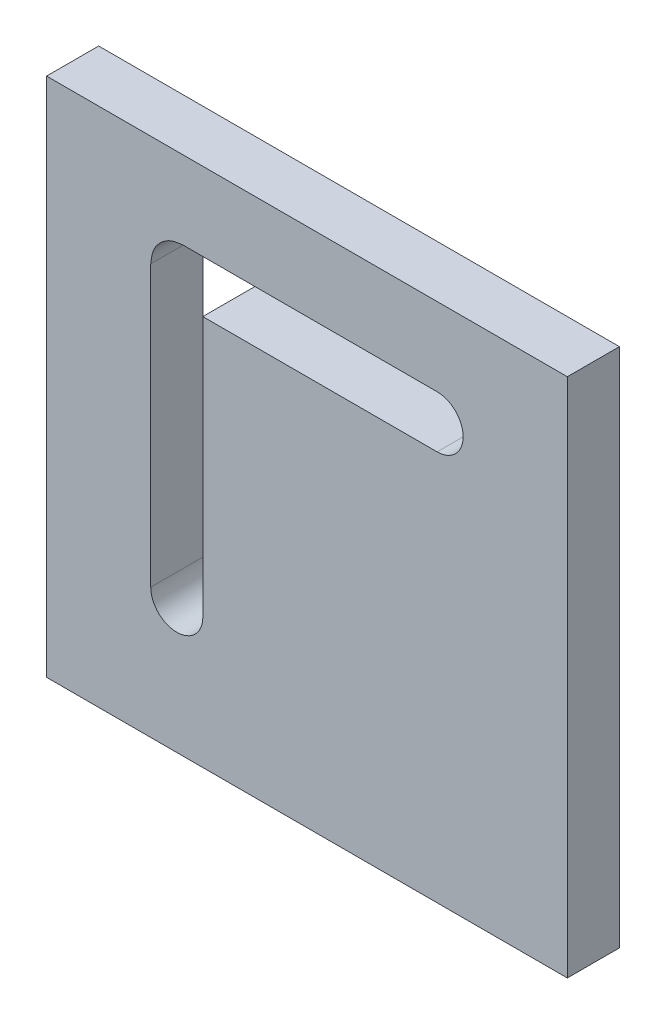
ISO-10303-21;
HEADER;
FILE_DESCRIPTION(('STEP AP214'),'2;1');
FILE_NAME('part.step','',(''),(''),'','','');
FILE_SCHEMA(('AUTOMOTIVE_DESIGN { 1 0 10303 214 1 1 1 1 }'));
ENDSEC;
DATA;
#1=APPLICATION_CONTEXT('core data for automotive mechanical design processes');
#2=APPLICATION_PROTOCOL_DEFINITION('international standard','automotive_design',2000,#1);
#3=PRODUCT_CONTEXT('',#1,'mechanical');
#4=PRODUCT('Part','Part','',(#3));
#5=PRODUCT_RELATED_PRODUCT_CATEGORY('part','',(#4));
#6=PRODUCT_DEFINITION_FORMATION('','',#4);
#7=PRODUCT_DEFINITION_CONTEXT('part definition',#1,'design');
#8=PRODUCT_DEFINITION('design','',#6,#7);
#9=PRODUCT_DEFINITION_SHAPE('','',#8);
#10=(LENGTH_UNIT() NAMED_UNIT(*) SI_UNIT(.MILLI.,.METRE.));
#11=(NAMED_UNIT(*) PLANE_ANGLE_UNIT() SI_UNIT($,.RADIAN.));
#12=(NAMED_UNIT(*) SI_UNIT($,.STERADIAN.) SOLID_ANGLE_UNIT());
#13=UNCERTAINTY_MEASURE_WITH_UNIT(LENGTH_MEASURE(1.E-05),#10,'distance_accuracy_value','');
#14=(GEOMETRIC_REPRESENTATION_CONTEXT(3) GLOBAL_UNCERTAINTY_ASSIGNED_CONTEXT((#13)) GLOBAL_UNIT_ASSIGNED_CONTEXT((#10,
#11,#12)) REPRESENTATION_CONTEXT('',''));
#15=CARTESIAN_POINT('',(0.,0.,0.));
#16=DIRECTION('',(0.,0.,1.));
#17=DIRECTION('',(1.,0.,0.));
#18=AXIS2_PLACEMENT_3D('',#15,#16,#17);
#19=CARTESIAN_POINT('',(0.,0.,10.));
#20=DIRECTION('',(0.,0.,1.));
#21=DIRECTION('',(1.,0.,0.));
#22=AXIS2_PLACEMENT_3D('',#19,#20,#21);
#23=PLANE('',#22);
#24=DIRECTION('',(0.,-1.,0.));
#25=VECTOR('',#24,1.);
#26=CARTESIAN_POINT('',(-50.,-50.,10.));
#27=LINE('',#26,#25);
#28=CARTESIAN_POINT('',(-50.,50.,10.));
#29=VERTEX_POINT('',#28);
#30=CARTESIAN_POINT('',(-50.,-50.,10.));
#31=VERTEX_POINT('',#30);
#32=EDGE_CURVE('E188',#29,#31,#27,.T.);
#33=ORIENTED_EDGE('',*,*,#32,.T.);
#34=DIRECTION('',(1.,0.,0.));
#35=VECTOR('',#34,1.);
#36=CARTESIAN_POINT('',(50.,-50.,10.));
#37=LINE('',#36,#35);
#38=CARTESIAN_POINT('',(50.,-50.,10.));
#39=VERTEX_POINT('',#38);
#40=EDGE_CURVE('E191',#31,#39,#37,.T.);
#41=ORIENTED_EDGE('',*,*,#40,.T.);
#42=DIRECTION('',(0.,1.,0.));
#43=VECTOR('',#42,1.);
#44=CARTESIAN_POINT('',(50.,-50.,10.));
#45=LINE('',#44,#43);
#46=CARTESIAN_POINT('',(50.,50.,10.));
#47=VERTEX_POINT('',#46);
#48=EDGE_CURVE('E194',#39,#47,#45,.T.);
#49=ORIENTED_EDGE('',*,*,#48,.T.);
#50=DIRECTION('',(-1.,0.,0.));
#51=VECTOR('',#50,1.);
#52=CARTESIAN_POINT('',(50.,50.,10.));
#53=LINE('',#52,#51);
#54=EDGE_CURVE('E196',#47,#29,#53,.T.);
#55=ORIENTED_EDGE('',*,*,#54,.T.);
#56=EDGE_LOOP('',(#33,#41,#49,#55));
#57=FACE_BOUND('',#56,.T.);
#58=DIRECTION('',(-1.,0.,0.));
#59=VECTOR('',#58,1.);
#60=CARTESIAN_POINT('',(0.,35.,10.));
#61=LINE('',#60,#59);
#62=CARTESIAN_POINT('',(25.,35.,10.));
#63=VERTEX_POINT('',#62);
#64=CARTESIAN_POINT('',(-23.766,35.,10.));
#65=VERTEX_POINT('',#64);
#66=EDGE_CURVE('E260',#63,#65,#61,.T.);
#67=ORIENTED_EDGE('',*,*,#66,.F.);
#68=CARTESIAN_POINT('',(25.,30.,10.));
#69=DIRECTION('',(0.,0.,1.));
#70=DIRECTION('',(1.,0.,0.));
#71=AXIS2_PLACEMENT_3D('',#68,#69,#70);
#72=CIRCLE('',#71,5.);
#73=CARTESIAN_POINT('',(25.,25.,10.));
#74=VERTEX_POINT('',#73);
#75=EDGE_CURVE('E163',#63,#74,#72,.F.);
#76=ORIENTED_EDGE('',*,*,#75,.T.);
#77=DIRECTION('',(1.,0.,0.));
#78=VECTOR('',#77,1.);
#79=CARTESIAN_POINT('',(0.,25.,10.));
#80=LINE('',#79,#78);
#81=CARTESIAN_POINT('',(-20.,25.,10.));
#82=VERTEX_POINT('',#81);
#83=EDGE_CURVE('E179',#82,#74,#80,.T.);
#84=ORIENTED_EDGE('',*,*,#83,.F.);
#85=DIRECTION('',(0.,-1.,0.));
#86=VECTOR('',#85,1.);
#87=CARTESIAN_POINT('',(-20.,0.,10.));
#88=LINE('',#87,#86);
#89=CARTESIAN_POINT('',(-20.,-25.,10.));
#90=VERTEX_POINT('',#89);
#91=EDGE_CURVE('E169',#82,#90,#88,.T.);
#92=ORIENTED_EDGE('',*,*,#91,.T.);
#93=CARTESIAN_POINT('',(-25.,-25.,10.));
#94=DIRECTION('',(0.,0.,1.));
#95=DIRECTION('',(1.,0.,0.));
#96=AXIS2_PLACEMENT_3D('',#93,#94,#95);
#97=CIRCLE('',#96,5.);
#98=CARTESIAN_POINT('',(-30.,-25.,10.));
#99=VERTEX_POINT('',#98);
#100=EDGE_CURVE('E158',#90,#99,#97,.F.);
#101=ORIENTED_EDGE('',*,*,#100,.T.);
#102=DIRECTION('',(0.,1.,0.));
#103=VECTOR('',#102,1.);
#104=CARTESIAN_POINT('',(-30.,0.,10.));
#105=LINE('',#104,#103);
#106=CARTESIAN_POINT('',(-30.,28.766,10.));
#107=VERTEX_POINT('',#106);
#108=EDGE_CURVE('E180',#99,#107,#105,.T.);
#109=ORIENTED_EDGE('',*,*,#108,.T.);
#110=CARTESIAN_POINT('',(-23.766,35.,10.));
#111=CARTESIAN_POINT('',(-23.8739069274394,34.9876188929279,10.));
#112=CARTESIAN_POINT('',(-23.9818217879403,34.9752419621992,10.));
#113=CARTESIAN_POINT('',(-24.1984027802386,34.9494679931689,10.));
#114=CARTESIAN_POINT('',(-24.3070680255185,34.9360635944539,10.));
#115=CARTESIAN_POINT('',(-24.52463649771,34.9073108534872,10.));
#116=CARTESIAN_POINT('',(-24.6335386540032,34.891954181966,10.));
#117=CARTESIAN_POINT('',(-24.8510561497617,34.8583318236321,10.));
#118=CARTESIAN_POINT('',(-24.9596708836831,34.8400621401956,10.));
#119=CARTESIAN_POINT('',(-25.1747920015728,34.7998717775254,10.));
#120=CARTESIAN_POINT('',(-25.2813075428666,34.7780010317403,10.));
#121=CARTESIAN_POINT('',(-25.4930156170352,34.7295152508965,10.));
#122=CARTESIAN_POINT('',(-25.5982105814736,34.7029109669723,10.));
#123=CARTESIAN_POINT('',(-25.8067684930942,34.6440344512228,10.));
#124=CARTESIAN_POINT('',(-25.9101351258383,34.6117755186243,10.));
#125=CARTESIAN_POINT('',(-26.0634245601331,34.5584816421322,10.));
#126=CARTESIAN_POINT('',(-26.1142084969487,34.5399074924864,10.));
#127=CARTESIAN_POINT('',(-26.2151142864299,34.5010404214258,10.));
#128=CARTESIAN_POINT('',(-26.2652361334782,34.4807474854395,10.));
#129=CARTESIAN_POINT('',(-26.4200528911557,34.4150720465931,9.99999999999999));
#130=CARTESIAN_POINT('',(-26.5235556812809,34.3668476606767,10.));
#131=CARTESIAN_POINT('',(-26.7273283539718,34.2636442241356,10.));
#132=CARTESIAN_POINT('',(-26.8275925933127,34.2086541095392,10.));
#133=CARTESIAN_POINT('',(-27.02457500856,34.0925685157264,10.));
#134=CARTESIAN_POINT('',(-27.1212915947715,34.0314703441049,10.));
#135=CARTESIAN_POINT('',(-27.3113036308443,33.9035491050413,10.));
#136=CARTESIAN_POINT('',(-27.4045870903062,33.8367082744492,10.));
#137=CARTESIAN_POINT('',(-27.5872650662235,33.698025502559,10.));
#138=CARTESIAN_POINT('',(-27.6766618407217,33.6261865298578,10.));
#139=CARTESIAN_POINT('',(-27.8515511266277,33.4779218049657,10.));
#140=CARTESIAN_POINT('',(-27.9370438649846,33.4014963199968,10.));
#141=CARTESIAN_POINT('',(-28.1037200288843,33.2448287335897,10.));
#142=CARTESIAN_POINT('',(-28.1849213065404,33.1646055986817,10.));
#143=CARTESIAN_POINT('',(-28.3432874830283,33.0002536907238,10.));
#144=CARTESIAN_POINT('',(-28.420452050928,32.9161245985249,10.));
#145=CARTESIAN_POINT('',(-28.5703520109225,32.7439664982071,10.));
#146=CARTESIAN_POINT('',(-28.6430863431588,32.6559365655123,10.));
#147=CARTESIAN_POINT('',(-28.7832515135477,32.4766139138513,10.));
#148=CARTESIAN_POINT('',(-28.8507121501027,32.3853445244413,10.));
#149=CARTESIAN_POINT('',(-28.9803290535681,32.1991258655393,10.));
#150=CARTESIAN_POINT('',(-29.0424861613237,32.104177182863,10.));
#151=CARTESIAN_POINT('',(-29.1609541351194,31.9107325180203,10.));
#152=CARTESIAN_POINT('',(-29.217266686545,31.8122375695817,10.));
#153=CARTESIAN_POINT('',(-29.3251876288867,31.6086035580117,10.));
#154=CARTESIAN_POINT('',(-29.3765866579901,31.5033526962924,10.));
#155=CARTESIAN_POINT('',(-29.4480459322082,31.3429736843757,10.));
#156=CARTESIAN_POINT('',(-29.4709283485519,31.2890899226117,10.));
#157=CARTESIAN_POINT('',(-29.5147072071632,31.1805217685738,10.));
#158=CARTESIAN_POINT('',(-29.5356036940769,31.1258373943305,10.));
#159=CARTESIAN_POINT('',(-29.5953242768373,30.96074326411,10.));
#160=CARTESIAN_POINT('',(-29.631195068065,30.8492574989117,10.));
#161=CARTESIAN_POINT('',(-29.6963456735776,30.623685635975,10.));
#162=CARTESIAN_POINT('',(-29.7255842294909,30.509587874425,10.));
#163=CARTESIAN_POINT('',(-29.7784123444368,30.2800665125791,10.));
#164=CARTESIAN_POINT('',(-29.8019998128343,30.1646424381084,10.));
#165=CARTESIAN_POINT('',(-29.8447745519621,29.9329824326783,10.));
#166=CARTESIAN_POINT('',(-29.8639612088814,29.8167463907952,10.));
#167=CARTESIAN_POINT('',(-29.8933517445818,29.6223051447381,10.));
#168=CARTESIAN_POINT('',(-29.9044285707921,29.5442282622241,10.));
#169=CARTESIAN_POINT('',(-29.9255244256119,29.3879624201673,10.));
#170=CARTESIAN_POINT('',(-29.9355438524562,29.3097735141408,10.));
#171=CARTESIAN_POINT('',(-29.9547997567078,29.1540181278065,10.));
#172=CARTESIAN_POINT('',(-29.964042490832,29.0764524074146,10.));
#173=CARTESIAN_POINT('',(-29.9821899483981,28.9212573373738,10.));
#174=CARTESIAN_POINT('',(-29.9910945684861,28.8436279755623,10.));
#175=CARTESIAN_POINT('',(-30.,28.766,10.));
#176=B_SPLINE_CURVE_WITH_KNOTS('',3,(#110,#111,#112,#113,#114,#115,#116,#117,#118,#119,#120,
#121,#122,#123,#124,#125,#126,#127,#128,#129,#130,#131,#132,#133,#134,#135,#136,#137,#138,#139,
#140,#141,#142,#143,#144,#145,#146,#147,#148,#149,#150,#151,#152,#153,#154,#155,#156,#157,#158,
#159,#160,#161,#162,#163,#164,#165,#166,#167,#168,#169,#170,#171,#172,#173,#174,#175),
.UNSPECIFIED.,.F.,.F.,(4,2,2,2,2,2,2,2,2,2,2,2,2,2,2,2,2,2,2,2,2,2,2,2,2,2,2,2,2,2,2,2,4),(0.,
0.325857227813951,0.654318014574611,0.984230402356271,1.31459938446562,1.64072301156055,
1.96611516619593,2.29075205185333,2.45294624607904,2.61514181548164,2.95741191564758,
3.30024935975661,3.64323859709621,3.98732984590624,4.33121844161572,4.67508702090112,
5.01738957108701,5.35972013961842,5.70213228582782,6.04244380668475,6.38270127238257,
6.72286034434635,7.07395214429409,7.24954245233894,7.42512881196179,7.77618688665632,
8.12937236062728,8.48268829545766,8.83605347973232,9.07262216747181,9.30910143901807,
9.5434438583356,9.77785734355579),.UNSPECIFIED.);
#177=EDGE_CURVE('E184',#65,#107,#176,.T.);
#178=ORIENTED_EDGE('',*,*,#177,.F.);
#179=EDGE_LOOP('',(#67,#76,#84,#92,#101,#109,#178));
#180=FACE_BOUND('',#179,.T.);
#181=ADVANCED_FACE('F78',(#57,#180),#23,.T.);
#182=CARTESIAN_POINT('',(0.,0.,0.));
#183=DIRECTION('',(0.,0.,1.));
#184=DIRECTION('',(1.,0.,0.));
#185=AXIS2_PLACEMENT_3D('',#182,#183,#184);
#186=PLANE('',#185);
#187=DIRECTION('',(0.,-1.,0.));
#188=VECTOR('',#187,1.);
#189=CARTESIAN_POINT('',(-50.,-50.,0.));
#190=LINE('',#189,#188);
#191=CARTESIAN_POINT('',(-50.,50.,0.));
#192=VERTEX_POINT('',#191);
#193=CARTESIAN_POINT('',(-50.,-50.,0.));
#194=VERTEX_POINT('',#193);
#195=EDGE_CURVE('E182',#192,#194,#190,.T.);
#196=ORIENTED_EDGE('',*,*,#195,.F.);
#197=DIRECTION('',(-1.,0.,0.));
#198=VECTOR('',#197,1.);
#199=CARTESIAN_POINT('',(50.,50.,0.));
#200=LINE('',#199,#198);
#201=CARTESIAN_POINT('',(50.,50.,0.));
#202=VERTEX_POINT('',#201);
#203=EDGE_CURVE('E192',#202,#192,#200,.T.);
#204=ORIENTED_EDGE('',*,*,#203,.F.);
#205=DIRECTION('',(0.,1.,0.));
#206=VECTOR('',#205,1.);
#207=CARTESIAN_POINT('',(50.,-50.,0.));
#208=LINE('',#207,#206);
#209=CARTESIAN_POINT('',(50.,-50.,0.));
#210=VERTEX_POINT('',#209);
#211=EDGE_CURVE('E203',#210,#202,#208,.T.);
#212=ORIENTED_EDGE('',*,*,#211,.F.);
#213=DIRECTION('',(1.,0.,0.));
#214=VECTOR('',#213,1.);
#215=CARTESIAN_POINT('',(50.,-50.,0.));
#216=LINE('',#215,#214);
#217=EDGE_CURVE('E201',#194,#210,#216,.T.);
#218=ORIENTED_EDGE('',*,*,#217,.F.);
#219=EDGE_LOOP('',(#196,#204,#212,#218));
#220=FACE_BOUND('',#219,.T.);
#221=CARTESIAN_POINT('',(25.,30.0000000000002,0.));
#222=DIRECTION('',(0.,0.,1.));
#223=DIRECTION('',(1.,0.,0.));
#224=AXIS2_PLACEMENT_3D('',#221,#222,#223);
#225=CIRCLE('',#224,5.);
#226=CARTESIAN_POINT('',(25.,35.0000000000002,0.));
#227=VERTEX_POINT('',#226);
#228=CARTESIAN_POINT('',(25.,25.0000000000002,0.));
#229=VERTEX_POINT('',#228);
#230=EDGE_CURVE('E86',#227,#229,#225,.F.);
#231=ORIENTED_EDGE('',*,*,#230,.F.);
#232=DIRECTION('',(-1.,0.,0.));
#233=VECTOR('',#232,1.);
#234=CARTESIAN_POINT('',(0.,35.0000000000002,0.));
#235=LINE('',#234,#233);
#236=CARTESIAN_POINT('',(-23.766,35.0000000000002,0.));
#237=VERTEX_POINT('',#236);
#238=EDGE_CURVE('E13',#227,#237,#235,.T.);
#239=ORIENTED_EDGE('',*,*,#238,.T.);
#240=CARTESIAN_POINT('',(-23.766,35.0000000000002,0.));
#241=CARTESIAN_POINT('',(-23.8739069274394,34.987618892928,0.));
#242=CARTESIAN_POINT('',(-23.9818217879403,34.9752419621993,0.));
#243=CARTESIAN_POINT('',(-24.1984027802386,34.949467993169,0.));
#244=CARTESIAN_POINT('',(-24.3070680255185,34.936063594454,0.));
#245=CARTESIAN_POINT('',(-24.52463649771,34.9073108534872,0.));
#246=CARTESIAN_POINT('',(-24.6335386540032,34.8919541819661,0.));
#247=CARTESIAN_POINT('',(-24.8510561497617,34.8583318236322,0.));
#248=CARTESIAN_POINT('',(-24.9596708836831,34.8400621401957,0.));
#249=CARTESIAN_POINT('',(-25.1747920015727,34.7998717775255,0.));
#250=CARTESIAN_POINT('',(-25.2813075428666,34.7780010317404,0.));
#251=CARTESIAN_POINT('',(-25.4930156170351,34.7295152508965,0.));
#252=CARTESIAN_POINT('',(-25.5982105814736,34.7029109669723,0.));
#253=CARTESIAN_POINT('',(-25.8067684930941,34.6440344512228,0.));
#254=CARTESIAN_POINT('',(-25.9101351258382,34.6117755186243,0.));
#255=CARTESIAN_POINT('',(-26.063424560133,34.5584816421322,0.));
#256=CARTESIAN_POINT('',(-26.1142084969487,34.5399074924864,0.));
#257=CARTESIAN_POINT('',(-26.2151142864299,34.5010404214258,0.));
#258=CARTESIAN_POINT('',(-26.2652361334782,34.4807474854395,0.));
#259=CARTESIAN_POINT('',(-26.4200528911556,34.4150720465931,0.));
#260=CARTESIAN_POINT('',(-26.5235556812809,34.3668476606767,0.));
#261=CARTESIAN_POINT('',(-26.7273283539718,34.2636442241356,0.));
#262=CARTESIAN_POINT('',(-26.8275925933127,34.2086541095392,0.));
#263=CARTESIAN_POINT('',(-27.0245750085601,34.0925685157264,0.));
#264=CARTESIAN_POINT('',(-27.1212915947715,34.0314703441049,0.));
#265=CARTESIAN_POINT('',(-27.3113036308443,33.9035491050412,0.));
#266=CARTESIAN_POINT('',(-27.4045870903062,33.8367082744491,0.));
#267=CARTESIAN_POINT('',(-27.5872650662236,33.6980255025589,0.));
#268=CARTESIAN_POINT('',(-27.6766618407217,33.6261865298578,0.));
#269=CARTESIAN_POINT('',(-27.8515511266277,33.4779218049657,0.));
#270=CARTESIAN_POINT('',(-27.9370438649847,33.4014963199968,0.));
#271=CARTESIAN_POINT('',(-28.1037200288843,33.2448287335897,0.));
#272=CARTESIAN_POINT('',(-28.1849213065405,33.1646055986816,0.));
#273=CARTESIAN_POINT('',(-28.3432874830284,33.0002536907237,0.));
#274=CARTESIAN_POINT('',(-28.4204520509281,32.9161245985248,0.));
#275=CARTESIAN_POINT('',(-28.5703520109226,32.743966498207,0.));
#276=CARTESIAN_POINT('',(-28.6430863431589,32.6559365655121,0.));
#277=CARTESIAN_POINT('',(-28.7832515135478,32.4766139138511,0.));
#278=CARTESIAN_POINT('',(-28.8507121501028,32.3853445244412,0.));
#279=CARTESIAN_POINT('',(-28.9803290535682,32.1991258655392,0.));
#280=CARTESIAN_POINT('',(-29.0424861613238,32.1041771828629,0.));
#281=CARTESIAN_POINT('',(-29.1609541351195,31.9107325180201,0.));
#282=CARTESIAN_POINT('',(-29.2172666865451,31.8122375695815,0.));
#283=CARTESIAN_POINT('',(-29.3251876288868,31.6086035580115,0.));
#284=CARTESIAN_POINT('',(-29.3765866579902,31.5033526962922,0.));
#285=CARTESIAN_POINT('',(-29.4480459322082,31.3429736843755,0.));
#286=CARTESIAN_POINT('',(-29.470928348552,31.2890899226115,0.));
#287=CARTESIAN_POINT('',(-29.5147072071633,31.1805217685736,0.));
#288=CARTESIAN_POINT('',(-29.5356036940769,31.1258373943304,0.));
#289=CARTESIAN_POINT('',(-29.5953242768373,30.9607432641098,0.));
#290=CARTESIAN_POINT('',(-29.6311950680651,30.8492574989116,0.));
#291=CARTESIAN_POINT('',(-29.6963456735776,30.6236856359748,0.));
#292=CARTESIAN_POINT('',(-29.7255842294909,30.5095878744248,0.));
#293=CARTESIAN_POINT('',(-29.7784123444369,30.280066512579,0.));
#294=CARTESIAN_POINT('',(-29.8019998128344,30.1646424381082,0.));
#295=CARTESIAN_POINT('',(-29.8447745519621,29.9329824326781,0.));
#296=CARTESIAN_POINT('',(-29.8639612088814,29.816746390795,0.));
#297=CARTESIAN_POINT('',(-29.8933517445818,29.622305144738,0.));
#298=CARTESIAN_POINT('',(-29.9044285707921,29.544228262224,0.));
#299=CARTESIAN_POINT('',(-29.9255244256119,29.3879624201673,0.));
#300=CARTESIAN_POINT('',(-29.9355438524562,29.3097735141407,0.));
#301=CARTESIAN_POINT('',(-29.9547997567078,29.1540181278065,0.));
#302=CARTESIAN_POINT('',(-29.964042490832,29.0764524074145,0.));
#303=CARTESIAN_POINT('',(-29.9821899483981,28.9212573373738,0.));
#304=CARTESIAN_POINT('',(-29.9910945684861,28.8436279755623,0.));
#305=CARTESIAN_POINT('',(-30.,28.766,0.));
#306=B_SPLINE_CURVE_WITH_KNOTS('',3,(#240,#241,#242,#243,#244,#245,#246,#247,#248,#249,#250,
#251,#252,#253,#254,#255,#256,#257,#258,#259,#260,#261,#262,#263,#264,#265,#266,#267,#268,#269,
#270,#271,#272,#273,#274,#275,#276,#277,#278,#279,#280,#281,#282,#283,#284,#285,#286,#287,#288,
#289,#290,#291,#292,#293,#294,#295,#296,#297,#298,#299,#300,#301,#302,#303,#304,#305),
.UNSPECIFIED.,.F.,.F.,(4,2,2,2,2,2,2,2,2,2,2,2,2,2,2,2,2,2,2,2,2,2,2,2,2,2,2,2,2,2,2,2,4),(0.,
0.325857227813944,0.654318014574599,0.984230402356256,1.31459938446561,1.64072301156053,
1.96611516619592,2.29075205185333,2.45294624607904,2.61514181548164,2.9574119156476,
3.30024935975664,3.64323859709627,3.98732984590632,4.33121844161581,4.67508702090123,
5.01738957108715,5.35972013961857,5.70213228582801,6.04244380668495,6.3827012723828,
6.72286034434661,7.07395214429432,7.24954245233917,7.42512881196201,7.77618688665652,
8.12937236062747,8.48268829545783,8.83605347973248,9.07262216747193,9.30910143901816,
9.54344385833565,9.77785734355581),.UNSPECIFIED.);
#307=CARTESIAN_POINT('',(-30.,28.766,0.));
#308=VERTEX_POINT('',#307);
#309=EDGE_CURVE('E222',#237,#308,#306,.T.);
#310=ORIENTED_EDGE('',*,*,#309,.T.);
#311=DIRECTION('',(0.,1.,0.));
#312=VECTOR('',#311,1.);
#313=CARTESIAN_POINT('',(-30.,0.,0.));
#314=LINE('',#313,#312);
#315=CARTESIAN_POINT('',(-30.,-25.,0.));
#316=VERTEX_POINT('',#315);
#317=EDGE_CURVE('E220',#316,#308,#314,.T.);
#318=ORIENTED_EDGE('',*,*,#317,.F.);
#319=CARTESIAN_POINT('',(-25.,-25.,0.));
#320=DIRECTION('',(0.,0.,1.));
#321=DIRECTION('',(1.,0.,0.));
#322=AXIS2_PLACEMENT_3D('',#319,#320,#321);
#323=CIRCLE('',#322,5.);
#324=CARTESIAN_POINT('',(-20.,-25.,0.));
#325=VERTEX_POINT('',#324);
#326=EDGE_CURVE('E217',#325,#316,#323,.F.);
#327=ORIENTED_EDGE('',*,*,#326,.F.);
#328=DIRECTION('',(0.,-1.,0.));
#329=VECTOR('',#328,1.);
#330=CARTESIAN_POINT('',(-20.,0.,0.));
#331=LINE('',#330,#329);
#332=CARTESIAN_POINT('',(-20.,25.0000000000001,0.));
#333=VERTEX_POINT('',#332);
#334=EDGE_CURVE('E172',#333,#325,#331,.T.);
#335=ORIENTED_EDGE('',*,*,#334,.F.);
#336=DIRECTION('',(1.,0.,0.));
#337=VECTOR('',#336,1.);
#338=CARTESIAN_POINT('',(0.,25.0000000000002,0.));
#339=LINE('',#338,#337);
#340=EDGE_CURVE('E231',#333,#229,#339,.T.);
#341=ORIENTED_EDGE('',*,*,#340,.T.);
#342=EDGE_LOOP('',(#231,#239,#310,#318,#327,#335,#341));
#343=FACE_BOUND('',#342,.T.);
#344=ADVANCED_FACE('F232',(#220,#343),#186,.F.);
#345=CARTESIAN_POINT('',(-50.,-50.,10.));
#346=DIRECTION('',(1.,0.,0.));
#347=DIRECTION('',(0.,0.,-1.));
#348=AXIS2_PLACEMENT_3D('',#345,#346,#347);
#349=PLANE('',#348);
#350=ORIENTED_EDGE('',*,*,#195,.T.);
#351=DIRECTION('',(0.,0.,-1.));
#352=VECTOR('',#351,1.);
#353=CARTESIAN_POINT('',(-50.,-50.,10.));
#354=LINE('',#353,#352);
#355=EDGE_CURVE('E214',#31,#194,#354,.T.);
#356=ORIENTED_EDGE('',*,*,#355,.F.);
#357=ORIENTED_EDGE('',*,*,#32,.F.);
#358=DIRECTION('',(0.,0.,-1.));
#359=VECTOR('',#358,1.);
#360=CARTESIAN_POINT('',(-50.,50.,10.));
#361=LINE('',#360,#359);
#362=EDGE_CURVE('E198',#29,#192,#361,.T.);
#363=ORIENTED_EDGE('',*,*,#362,.T.);
#364=EDGE_LOOP('',(#350,#356,#357,#363));
#365=FACE_BOUND('',#364,.T.);
#366=ADVANCED_FACE('F80',(#365),#349,.F.);
#367=CARTESIAN_POINT('',(50.,-50.,10.));
#368=DIRECTION('',(0.,1.,0.));
#369=DIRECTION('',(0.,0.,1.));
#370=AXIS2_PLACEMENT_3D('',#367,#368,#369);
#371=PLANE('',#370);
#372=ORIENTED_EDGE('',*,*,#217,.T.);
#373=DIRECTION('',(0.,0.,-1.));
#374=VECTOR('',#373,1.);
#375=CARTESIAN_POINT('',(50.,-50.,10.));
#376=LINE('',#375,#374);
#377=EDGE_CURVE('E211',#39,#210,#376,.T.);
#378=ORIENTED_EDGE('',*,*,#377,.F.);
#379=ORIENTED_EDGE('',*,*,#40,.F.);
#380=ORIENTED_EDGE('',*,*,#355,.T.);
#381=EDGE_LOOP('',(#372,#378,#379,#380));
#382=FACE_BOUND('',#381,.T.);
#383=ADVANCED_FACE('F358',(#382),#371,.F.);
#384=CARTESIAN_POINT('',(50.,-50.,10.));
#385=DIRECTION('',(-1.,0.,0.));
#386=DIRECTION('',(0.,0.,1.));
#387=AXIS2_PLACEMENT_3D('',#384,#385,#386);
#388=PLANE('',#387);
#389=ORIENTED_EDGE('',*,*,#211,.T.);
#390=DIRECTION('',(0.,0.,-1.));
#391=VECTOR('',#390,1.);
#392=CARTESIAN_POINT('',(50.,50.,10.));
#393=LINE('',#392,#391);
#394=EDGE_CURVE('E208',#47,#202,#393,.T.);
#395=ORIENTED_EDGE('',*,*,#394,.F.);
#396=ORIENTED_EDGE('',*,*,#48,.F.);
#397=ORIENTED_EDGE('',*,*,#377,.T.);
#398=EDGE_LOOP('',(#389,#395,#396,#397));
#399=FACE_BOUND('',#398,.T.);
#400=ADVANCED_FACE('F276',(#399),#388,.F.);
#401=CARTESIAN_POINT('',(50.,50.,10.));
#402=DIRECTION('',(0.,-1.,0.));
#403=DIRECTION('',(0.,0.,-1.));
#404=AXIS2_PLACEMENT_3D('',#401,#402,#403);
#405=PLANE('',#404);
#406=ORIENTED_EDGE('',*,*,#203,.T.);
#407=ORIENTED_EDGE('',*,*,#362,.F.);
#408=ORIENTED_EDGE('',*,*,#54,.F.);
#409=ORIENTED_EDGE('',*,*,#394,.T.);
#410=EDGE_LOOP('',(#406,#407,#408,#409));
#411=FACE_BOUND('',#410,.T.);
#412=ADVANCED_FACE('F271',(#411),#405,.F.);
#413=CARTESIAN_POINT('',(-30.,0.,0.));
#414=DIRECTION('',(1.,0.,0.));
#415=DIRECTION('',(0.,0.,-1.));
#416=AXIS2_PLACEMENT_3D('',#413,#414,#415);
#417=PLANE('',#416);
#418=DIRECTION('',(0.,0.,-1.));
#419=VECTOR('',#418,1.);
#420=CARTESIAN_POINT('',(-30.,-25.,24.));
#421=LINE('',#420,#419);
#422=EDGE_CURVE('E93',#316,#99,#421,.F.);
#423=ORIENTED_EDGE('',*,*,#422,.F.);
#424=ORIENTED_EDGE('',*,*,#317,.T.);
#425=DIRECTION('',(0.,0.,-1.));
#426=VECTOR('',#425,1.);
#427=CARTESIAN_POINT('',(-30.,28.766,24.));
#428=LINE('',#427,#426);
#429=EDGE_CURVE('E281',#308,#107,#428,.F.);
#430=ORIENTED_EDGE('',*,*,#429,.T.);
#431=ORIENTED_EDGE('',*,*,#108,.F.);
#432=EDGE_LOOP('',(#423,#424,#430,#431));
#433=FACE_BOUND('',#432,.T.);
#434=ADVANCED_FACE('F247',(#433),#417,.T.);
#435=CARTESIAN_POINT('',(-20.,0.,0.));
#436=DIRECTION('',(-1.,0.,0.));
#437=DIRECTION('',(0.,0.,1.));
#438=AXIS2_PLACEMENT_3D('',#435,#436,#437);
#439=PLANE('',#438);
#440=DIRECTION('',(0.,0.,1.));
#441=VECTOR('',#440,1.);
#442=CARTESIAN_POINT('',(-20.,25.0000000000001,3.59335577166626E-13));
#443=LINE('',#442,#441);
#444=EDGE_CURVE('E164',#333,#82,#443,.T.);
#445=ORIENTED_EDGE('',*,*,#444,.F.);
#446=ORIENTED_EDGE('',*,*,#334,.T.);
#447=DIRECTION('',(0.,0.,-1.));
#448=VECTOR('',#447,1.);
#449=CARTESIAN_POINT('',(-20.,-25.,24.));
#450=LINE('',#449,#448);
#451=EDGE_CURVE('E98',#90,#325,#450,.T.);
#452=ORIENTED_EDGE('',*,*,#451,.F.);
#453=ORIENTED_EDGE('',*,*,#91,.F.);
#454=EDGE_LOOP('',(#445,#446,#452,#453));
#455=FACE_BOUND('',#454,.T.);
#456=ADVANCED_FACE('F168',(#455),#439,.T.);
#457=CARTESIAN_POINT('',(-23.766,24.9999999999998,23.9999999999999));
#458=DIRECTION('',(0.,-1.,0.));
#459=DIRECTION('',(0.,0.,-1.));
#460=AXIS2_PLACEMENT_3D('',#457,#458,#459);
#461=PLANE('',#460);
#462=ORIENTED_EDGE('',*,*,#83,.T.);
#463=DIRECTION('',(0.,0.,-1.));
#464=VECTOR('',#463,1.);
#465=CARTESIAN_POINT('',(25.,24.9999999999998,23.9999999999999));
#466=LINE('',#465,#464);
#467=EDGE_CURVE('E293',#74,#229,#466,.T.);
#468=ORIENTED_EDGE('',*,*,#467,.T.);
#469=ORIENTED_EDGE('',*,*,#340,.F.);
#470=ORIENTED_EDGE('',*,*,#444,.T.);
#471=EDGE_LOOP('',(#462,#468,#469,#470));
#472=FACE_BOUND('',#471,.T.);
#473=ADVANCED_FACE('F244',(#472),#461,.F.);
#474=CARTESIAN_POINT('',(-30.,28.766,-4.));
#475=CARTESIAN_POINT('',(-29.9062931752438,29.5828849310881,-4.));
#476=CARTESIAN_POINT('',(-29.7188795257314,31.2166547932644,-4.00000000000001));
#477=CARTESIAN_POINT('',(-28.2772719311265,33.2772719311265,-4.));
#478=CARTESIAN_POINT('',(-26.2166547932643,34.7188795257314,-4.00000000000002));
#479=CARTESIAN_POINT('',(-24.5828849310881,34.9062931752439,-3.99999999999996));
#480=CARTESIAN_POINT('',(-23.766,35.0000000000002,-3.99999999999993));
#481=CARTESIAN_POINT('',(-30.,28.766,24.));
#482=CARTESIAN_POINT('',(-29.9062931752438,29.5828849310881,24.));
#483=CARTESIAN_POINT('',(-29.7188795257314,31.2166547932644,24.));
#484=CARTESIAN_POINT('',(-28.2772719311265,33.2772719311265,24.));
#485=CARTESIAN_POINT('',(-26.2166547932643,34.7188795257315,24.));
#486=CARTESIAN_POINT('',(-24.5828849310881,34.9062931752437,24.));
#487=CARTESIAN_POINT('',(-23.766,34.9999999999998,24.0000000000001));
#488=B_SPLINE_SURFACE_WITH_KNOTS('',1,3,((#474,#475,#476,#477,#478,#479,#480),(#481,#482,#483,
#484,#485,#486,#487)),.UNSPECIFIED.,.F.,.F.,.F.,(2,2),(4,1,1,1,4),(0.,1.),(0.,0.25,0.5,0.75,1.),.UNSPECIFIED.);
#489=DIRECTION('',(0.,0.,-1.));
#490=VECTOR('',#489,1.);
#491=CARTESIAN_POINT('',(-23.766,34.9999999999998,24.0000000000001));
#492=LINE('',#491,#490);
#493=EDGE_CURVE('E174',#237,#65,#492,.F.);
#494=ORIENTED_EDGE('',*,*,#177,.T.);
#495=ORIENTED_EDGE('',*,*,#429,.F.);
#496=ORIENTED_EDGE('',*,*,#309,.F.);
#497=ORIENTED_EDGE('',*,*,#493,.T.);
#498=EDGE_LOOP('',(#494,#495,#496,#497));
#499=FACE_BOUND('',#498,.T.);
#500=ADVANCED_FACE('F236',(#499),#488,.F.);
#501=CARTESIAN_POINT('',(-23.766,35.0000000000002,-3.99999999999993));
#502=DIRECTION('',(0.,1.,0.));
#503=DIRECTION('',(0.,0.,1.));
#504=AXIS2_PLACEMENT_3D('',#501,#502,#503);
#505=PLANE('',#504);
#506=ORIENTED_EDGE('',*,*,#66,.T.);
#507=ORIENTED_EDGE('',*,*,#493,.F.);
#508=ORIENTED_EDGE('',*,*,#238,.F.);
#509=DIRECTION('',(0.,0.,-1.));
#510=VECTOR('',#509,1.);
#511=CARTESIAN_POINT('',(25.,34.9999999999998,24.0000000000001));
#512=LINE('',#511,#510);
#513=EDGE_CURVE('E291',#227,#63,#512,.F.);
#514=ORIENTED_EDGE('',*,*,#513,.T.);
#515=EDGE_LOOP('',(#506,#507,#508,#514));
#516=FACE_BOUND('',#515,.T.);
#517=ADVANCED_FACE('F243',(#516),#505,.F.);
#518=CARTESIAN_POINT('',(25.,29.9999999999998,24.));
#519=DIRECTION('',(0.,0.,-1.));
#520=DIRECTION('',(0.,1.,0.));
#521=AXIS2_PLACEMENT_3D('',#518,#519,#520);
#522=CYLINDRICAL_SURFACE('',#521,5.);
#523=ORIENTED_EDGE('',*,*,#513,.F.);
#524=ORIENTED_EDGE('',*,*,#230,.T.);
#525=ORIENTED_EDGE('',*,*,#467,.F.);
#526=ORIENTED_EDGE('',*,*,#75,.F.);
#527=EDGE_LOOP('',(#523,#524,#525,#526));
#528=FACE_BOUND('',#527,.T.);
#529=ADVANCED_FACE('F300',(#528),#522,.F.);
#530=CARTESIAN_POINT('',(-25.,-25.,24.));
#531=DIRECTION('',(0.,0.,-1.));
#532=DIRECTION('',(-1.,0.,0.));
#533=AXIS2_PLACEMENT_3D('',#530,#531,#532);
#534=CYLINDRICAL_SURFACE('',#533,5.);
#535=ORIENTED_EDGE('',*,*,#451,.T.);
#536=ORIENTED_EDGE('',*,*,#326,.T.);
#537=ORIENTED_EDGE('',*,*,#422,.T.);
#538=ORIENTED_EDGE('',*,*,#100,.F.);
#539=EDGE_LOOP('',(#535,#536,#537,#538));
#540=FACE_BOUND('',#539,.T.);
#541=ADVANCED_FACE('F159',(#540),#534,.F.);
#542=CLOSED_SHELL('',(#181,#344,#366,#383,#400,#412,#434,#456,#473,#500,#517,#529,#541));
#543=MANIFOLD_SOLID_BREP('B2',#542);
#544=ADVANCED_BREP_SHAPE_REPRESENTATION('',(#18,#543),#14);
#545=SHAPE_DEFINITION_REPRESENTATION(#9,#544);
ENDSEC;
END-ISO-10303-21;
